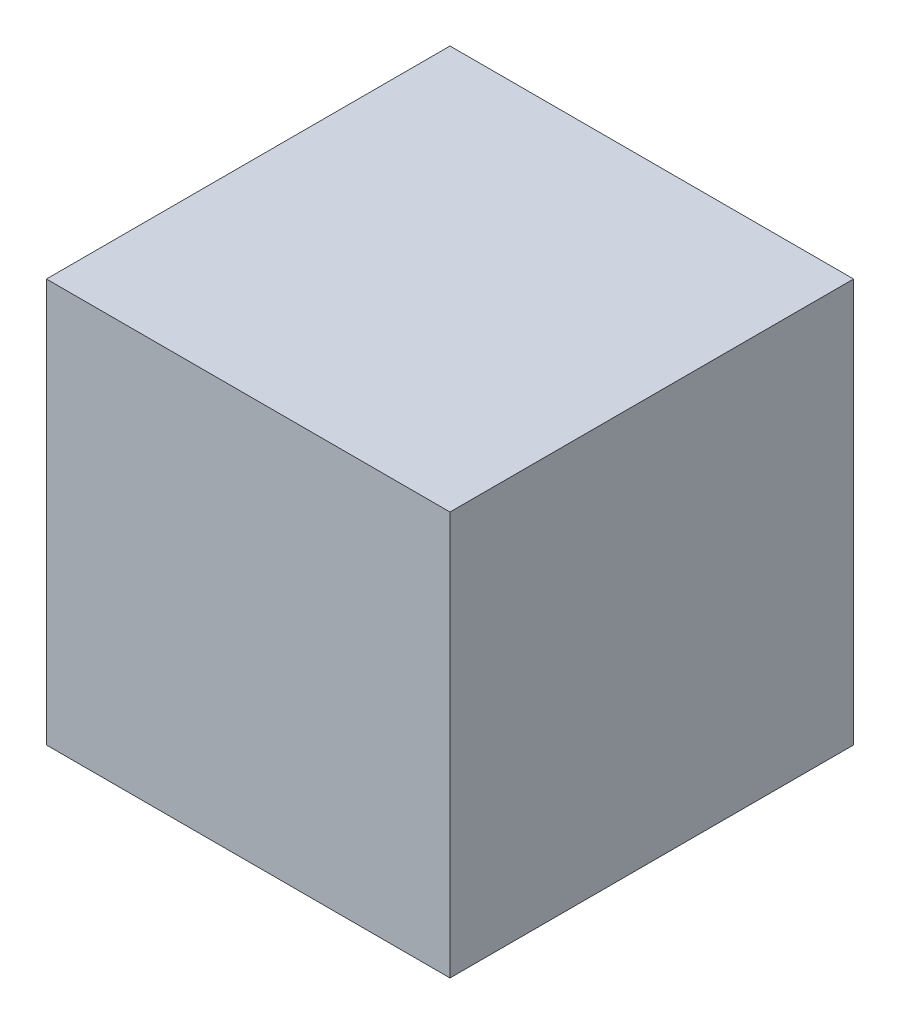
ISO-10303-21;
HEADER;
FILE_DESCRIPTION(('STEP AP214'),'2;1');
FILE_NAME('part.step','',(''),(''),'','','');
FILE_SCHEMA(('AUTOMOTIVE_DESIGN { 1 0 10303 214 1 1 1 1 }'));
ENDSEC;
DATA;
#1=APPLICATION_CONTEXT('core data for automotive mechanical design processes');
#2=APPLICATION_PROTOCOL_DEFINITION('international standard','automotive_design',2000,#1);
#3=PRODUCT_CONTEXT('',#1,'mechanical');
#4=PRODUCT('Part','Part','',(#3));
#5=PRODUCT_RELATED_PRODUCT_CATEGORY('part','',(#4));
#6=PRODUCT_DEFINITION_FORMATION('','',#4);
#7=PRODUCT_DEFINITION_CONTEXT('part definition',#1,'design');
#8=PRODUCT_DEFINITION('design','',#6,#7);
#9=PRODUCT_DEFINITION_SHAPE('','',#8);
#10=(LENGTH_UNIT() NAMED_UNIT(*) SI_UNIT(.MILLI.,.METRE.));
#11=(NAMED_UNIT(*) PLANE_ANGLE_UNIT() SI_UNIT($,.RADIAN.));
#12=(NAMED_UNIT(*) SI_UNIT($,.STERADIAN.) SOLID_ANGLE_UNIT());
#13=UNCERTAINTY_MEASURE_WITH_UNIT(LENGTH_MEASURE(1.E-05),#10,'distance_accuracy_value','');
#14=(GEOMETRIC_REPRESENTATION_CONTEXT(3) GLOBAL_UNCERTAINTY_ASSIGNED_CONTEXT((#13)) GLOBAL_UNIT_ASSIGNED_CONTEXT((#10,
#11,#12)) REPRESENTATION_CONTEXT('',''));
#15=CARTESIAN_POINT('',(0.,0.,0.));
#16=DIRECTION('',(0.,0.,1.));
#17=DIRECTION('',(1.,0.,0.));
#18=AXIS2_PLACEMENT_3D('',#15,#16,#17);
#19=CARTESIAN_POINT('',(-0.127,0.12699746,0.));
#20=DIRECTION('',(1.,0.,0.));
#21=DIRECTION('',(0.,-1.,0.));
#22=AXIS2_PLACEMENT_3D('',#19,#20,#21);
#23=PLANE('',#22);
#24=DIRECTION('',(0.,-1.,0.));
#25=VECTOR('',#24,1.);
#26=CARTESIAN_POINT('',(-0.127,0.12699746,0.));
#27=LINE('',#26,#25);
#28=CARTESIAN_POINT('',(-0.127,0.12699746,0.));
#29=VERTEX_POINT('',#28);
#30=CARTESIAN_POINT('',(-0.127,-0.127,0.));
#31=VERTEX_POINT('',#30);
#32=EDGE_CURVE('E11',#29,#31,#27,.T.);
#33=ORIENTED_EDGE('',*,*,#32,.T.);
#34=DIRECTION('',(0.,0.,1.));
#35=VECTOR('',#34,1.);
#36=CARTESIAN_POINT('',(-0.127,-0.127,0.));
#37=LINE('',#36,#35);
#38=CARTESIAN_POINT('',(-0.127,-0.127,0.254));
#39=VERTEX_POINT('',#38);
#40=EDGE_CURVE('E25',#31,#39,#37,.T.);
#41=ORIENTED_EDGE('',*,*,#40,.T.);
#42=DIRECTION('',(0.,-1.,0.));
#43=VECTOR('',#42,1.);
#44=CARTESIAN_POINT('',(-0.127,0.12699746,0.254));
#45=LINE('',#44,#43);
#46=CARTESIAN_POINT('',(-0.127,0.12699746,0.254));
#47=VERTEX_POINT('',#46);
#48=EDGE_CURVE('E96',#47,#39,#45,.T.);
#49=ORIENTED_EDGE('',*,*,#48,.F.);
#50=DIRECTION('',(0.,0.,1.));
#51=VECTOR('',#50,1.);
#52=CARTESIAN_POINT('',(-0.127,0.12699746,0.));
#53=LINE('',#52,#51);
#54=EDGE_CURVE('E91',#29,#47,#53,.T.);
#55=ORIENTED_EDGE('',*,*,#54,.F.);
#56=EDGE_LOOP('',(#33,#41,#49,#55));
#57=FACE_BOUND('',#56,.T.);
#58=ADVANCED_FACE('F17',(#57),#23,.F.);
#59=CARTESIAN_POINT('',(0.127,0.127,0.));
#60=DIRECTION('',(1.000000009958E-05,-0.99999999995,0.));
#61=DIRECTION('',(-0.99999999995,-1.000000009958E-05,0.));
#62=AXIS2_PLACEMENT_3D('',#59,#60,#61);
#63=PLANE('',#62);
#64=DIRECTION('',(-0.99999999995,-1.000000009958E-05,0.));
#65=VECTOR('',#64,1.);
#66=CARTESIAN_POINT('',(0.127,0.127,0.));
#67=LINE('',#66,#65);
#68=CARTESIAN_POINT('',(0.127,0.127,0.));
#69=VERTEX_POINT('',#68);
#70=EDGE_CURVE('E73',#69,#29,#67,.T.);
#71=ORIENTED_EDGE('',*,*,#70,.T.);
#72=ORIENTED_EDGE('',*,*,#54,.T.);
#73=DIRECTION('',(-0.99999999995,-1.000000009958E-05,0.));
#74=VECTOR('',#73,1.);
#75=CARTESIAN_POINT('',(0.127,0.127,0.254));
#76=LINE('',#75,#74);
#77=CARTESIAN_POINT('',(0.127,0.127,0.254));
#78=VERTEX_POINT('',#77);
#79=EDGE_CURVE('E76',#78,#47,#76,.T.);
#80=ORIENTED_EDGE('',*,*,#79,.F.);
#81=DIRECTION('',(0.,0.,1.));
#82=VECTOR('',#81,1.);
#83=CARTESIAN_POINT('',(0.127,0.127,0.));
#84=LINE('',#83,#82);
#85=EDGE_CURVE('E74',#69,#78,#84,.T.);
#86=ORIENTED_EDGE('',*,*,#85,.F.);
#87=EDGE_LOOP('',(#71,#72,#80,#86));
#88=FACE_BOUND('',#87,.T.);
#89=ADVANCED_FACE('F108',(#88),#63,.F.);
#90=CARTESIAN_POINT('',(0.12699746,-0.127,0.));
#91=DIRECTION('',(-0.99999999995,9.999999875784E-06,0.));
#92=DIRECTION('',(9.999999875784E-06,0.99999999995,0.));
#93=AXIS2_PLACEMENT_3D('',#90,#91,#92);
#94=PLANE('',#93);
#95=DIRECTION('',(9.999999875784E-06,0.99999999995,0.));
#96=VECTOR('',#95,1.);
#97=CARTESIAN_POINT('',(0.12699746,-0.127,0.));
#98=LINE('',#97,#96);
#99=CARTESIAN_POINT('',(0.12699746,-0.127,0.));
#100=VERTEX_POINT('',#99);
#101=EDGE_CURVE('E59',#100,#69,#98,.T.);
#102=ORIENTED_EDGE('',*,*,#101,.T.);
#103=ORIENTED_EDGE('',*,*,#85,.T.);
#104=DIRECTION('',(9.999999875784E-06,0.99999999995,0.));
#105=VECTOR('',#104,1.);
#106=CARTESIAN_POINT('',(0.12699746,-0.127,0.254));
#107=LINE('',#106,#105);
#108=CARTESIAN_POINT('',(0.12699746,-0.127,0.254));
#109=VERTEX_POINT('',#108);
#110=EDGE_CURVE('E62',#109,#78,#107,.T.);
#111=ORIENTED_EDGE('',*,*,#110,.F.);
#112=DIRECTION('',(0.,0.,1.));
#113=VECTOR('',#112,1.);
#114=CARTESIAN_POINT('',(0.12699746,-0.127,0.));
#115=LINE('',#114,#113);
#116=EDGE_CURVE('E54',#100,#109,#115,.T.);
#117=ORIENTED_EDGE('',*,*,#116,.F.);
#118=EDGE_LOOP('',(#102,#103,#111,#117));
#119=FACE_BOUND('',#118,.T.);
#120=ADVANCED_FACE('F56',(#119),#94,.F.);
#121=CARTESIAN_POINT('',(-0.127,-0.127,0.));
#122=DIRECTION('',(0.,1.,0.));
#123=DIRECTION('',(1.,0.,0.));
#124=AXIS2_PLACEMENT_3D('',#121,#122,#123);
#125=PLANE('',#124);
#126=DIRECTION('',(1.,0.,0.));
#127=VECTOR('',#126,1.);
#128=CARTESIAN_POINT('',(-0.127,-0.127,0.));
#129=LINE('',#128,#127);
#130=EDGE_CURVE('E65',#31,#100,#129,.T.);
#131=ORIENTED_EDGE('',*,*,#130,.T.);
#132=ORIENTED_EDGE('',*,*,#116,.T.);
#133=DIRECTION('',(1.,0.,0.));
#134=VECTOR('',#133,1.);
#135=CARTESIAN_POINT('',(-0.127,-0.127,0.254));
#136=LINE('',#135,#134);
#137=EDGE_CURVE('E69',#39,#109,#136,.T.);
#138=ORIENTED_EDGE('',*,*,#137,.F.);
#139=ORIENTED_EDGE('',*,*,#40,.F.);
#140=EDGE_LOOP('',(#131,#132,#138,#139));
#141=FACE_BOUND('',#140,.T.);
#142=ADVANCED_FACE('F67',(#141),#125,.F.);
#143=CARTESIAN_POINT('',(-3.174967997485E-07,-3.174968210741E-07,0.254));
#144=DIRECTION('',(0.,0.,1.));
#145=DIRECTION('',(1.,0.,0.));
#146=AXIS2_PLACEMENT_3D('',#143,#144,#145);
#147=PLANE('',#146);
#148=ORIENTED_EDGE('',*,*,#48,.T.);
#149=ORIENTED_EDGE('',*,*,#137,.T.);
#150=ORIENTED_EDGE('',*,*,#110,.T.);
#151=ORIENTED_EDGE('',*,*,#79,.T.);
#152=EDGE_LOOP('',(#148,#149,#150,#151));
#153=FACE_BOUND('',#152,.T.);
#154=ADVANCED_FACE('F106',(#153),#147,.T.);
#155=CARTESIAN_POINT('',(-3.174967997485E-07,-3.174968210741E-07,0.));
#156=DIRECTION('',(0.,0.,1.));
#157=DIRECTION('',(1.,0.,0.));
#158=AXIS2_PLACEMENT_3D('',#155,#156,#157);
#159=PLANE('',#158);
#160=ORIENTED_EDGE('',*,*,#70,.F.);
#161=ORIENTED_EDGE('',*,*,#101,.F.);
#162=ORIENTED_EDGE('',*,*,#130,.F.);
#163=ORIENTED_EDGE('',*,*,#32,.F.);
#164=EDGE_LOOP('',(#160,#161,#162,#163));
#165=FACE_BOUND('',#164,.T.);
#166=ADVANCED_FACE('F71',(#165),#159,.F.);
#167=CLOSED_SHELL('',(#58,#89,#120,#142,#154,#166));
#168=MANIFOLD_SOLID_BREP('B1',#167);
#169=ADVANCED_BREP_SHAPE_REPRESENTATION('',(#18,#168),#14);
#170=SHAPE_DEFINITION_REPRESENTATION(#9,#169);
ENDSEC;
END-ISO-10303-21;
